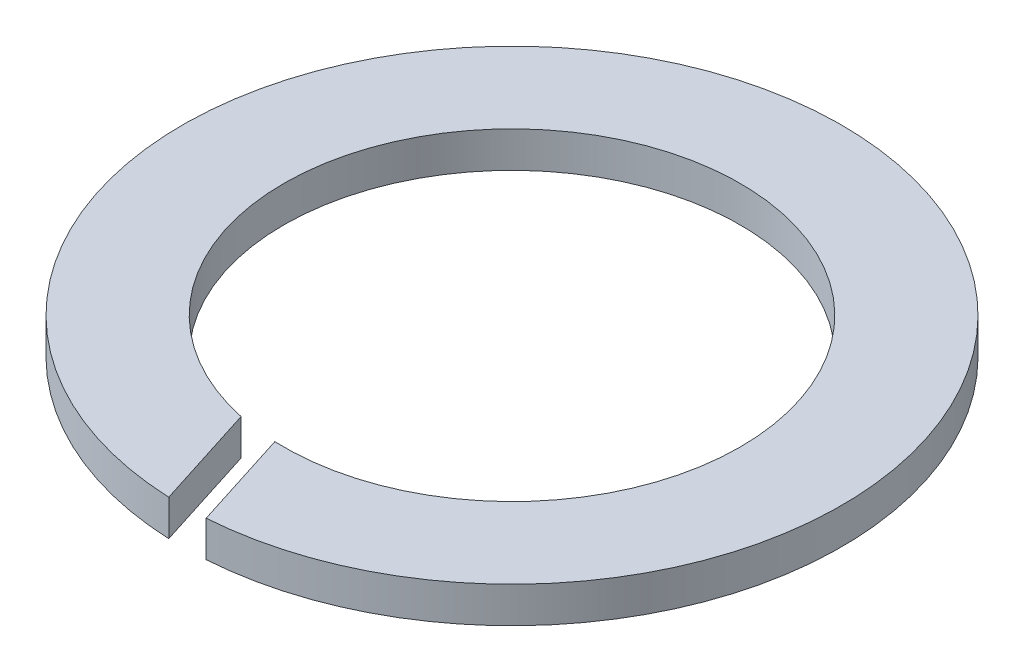
ISO-10303-21;
HEADER;
FILE_DESCRIPTION(('STEP AP214'),'2;1');
FILE_NAME('part.step','',(''),(''),'','','');
FILE_SCHEMA(('AUTOMOTIVE_DESIGN { 1 0 10303 214 1 1 1 1 }'));
ENDSEC;
DATA;
#1=APPLICATION_CONTEXT('core data for automotive mechanical design processes');
#2=APPLICATION_PROTOCOL_DEFINITION('international standard','automotive_design',2000,#1);
#3=PRODUCT_CONTEXT('',#1,'mechanical');
#4=PRODUCT('Part','Part','',(#3));
#5=PRODUCT_RELATED_PRODUCT_CATEGORY('part','',(#4));
#6=PRODUCT_DEFINITION_FORMATION('','',#4);
#7=PRODUCT_DEFINITION_CONTEXT('part definition',#1,'design');
#8=PRODUCT_DEFINITION('design','',#6,#7);
#9=PRODUCT_DEFINITION_SHAPE('','',#8);
#10=(LENGTH_UNIT() NAMED_UNIT(*) SI_UNIT(.MILLI.,.METRE.));
#11=(NAMED_UNIT(*) PLANE_ANGLE_UNIT() SI_UNIT($,.RADIAN.));
#12=(NAMED_UNIT(*) SI_UNIT($,.STERADIAN.) SOLID_ANGLE_UNIT());
#13=UNCERTAINTY_MEASURE_WITH_UNIT(LENGTH_MEASURE(1.E-05),#10,'distance_accuracy_value','');
#14=(GEOMETRIC_REPRESENTATION_CONTEXT(3) GLOBAL_UNCERTAINTY_ASSIGNED_CONTEXT((#13)) GLOBAL_UNIT_ASSIGNED_CONTEXT((#10,
#11,#12)) REPRESENTATION_CONTEXT('',''));
#15=CARTESIAN_POINT('',(0.,0.,0.));
#16=DIRECTION('',(0.,0.,1.));
#17=DIRECTION('',(1.,0.,0.));
#18=AXIS2_PLACEMENT_3D('',#15,#16,#17);
#19=CARTESIAN_POINT('',(0.,3.,0.));
#20=DIRECTION('',(0.,1.,0.));
#21=DIRECTION('',(0.,0.,1.));
#22=AXIS2_PLACEMENT_3D('',#19,#20,#21);
#23=PLANE('',#22);
#24=DIRECTION('',(0.302773703904432,0.,0.953062476558589));
#25=VECTOR('',#24,1.);
#26=CARTESIAN_POINT('',(-1.17083366932693,3.,27.4750641221958));
#27=LINE('',#26,#25);
#28=CARTESIAN_POINT('',(-3.98097039625581,3.,18.6293954465553));
#29=VERTEX_POINT('',#28);
#30=CARTESIAN_POINT('',(-1.17083366932693,3.,27.4750641221958));
#31=VERTEX_POINT('',#30);
#32=EDGE_CURVE('E77',#29,#31,#27,.T.);
#33=ORIENTED_EDGE('',*,*,#32,.F.);
#34=CARTESIAN_POINT('',(0.,3.,0.));
#35=DIRECTION('',(0.,1.,0.));
#36=DIRECTION('',(0.,0.,1.));
#37=AXIS2_PLACEMENT_3D('',#34,#35,#36);
#38=CIRCLE('',#37,19.05);
#39=CARTESIAN_POINT('',(-0.758402040441473,3.,19.0348975921872));
#40=VERTEX_POINT('',#39);
#41=EDGE_CURVE('E89',#40,#29,#38,.T.);
#42=ORIENTED_EDGE('',*,*,#41,.F.);
#43=DIRECTION('',(-0.302773703904432,0.,-0.953062476558589));
#44=VECTOR('',#43,1.);
#45=CARTESIAN_POINT('',(-1.17083366932693,3.,17.7366570099709));
#46=LINE('',#45,#44);
#47=CARTESIAN_POINT('',(1.90974292251743,3.,27.4336086209943));
#48=VERTEX_POINT('',#47);
#49=EDGE_CURVE('E59',#48,#40,#46,.T.);
#50=ORIENTED_EDGE('',*,*,#49,.F.);
#51=CARTESIAN_POINT('',(0.,3.,0.));
#52=DIRECTION('',(0.,1.,0.));
#53=DIRECTION('',(0.,0.,1.));
#54=AXIS2_PLACEMENT_3D('',#51,#52,#53);
#55=CIRCLE('',#54,27.5);
#56=EDGE_CURVE('E45',#48,#31,#55,.T.);
#57=ORIENTED_EDGE('',*,*,#56,.T.);
#58=EDGE_LOOP('',(#33,#42,#50,#57));
#59=FACE_BOUND('',#58,.T.);
#60=ADVANCED_FACE('F37',(#59),#23,.T.);
#61=CARTESIAN_POINT('',(0.,0.,0.));
#62=DIRECTION('',(0.,1.,0.));
#63=DIRECTION('',(0.,0.,1.));
#64=AXIS2_PLACEMENT_3D('',#61,#62,#63);
#65=PLANE('',#64);
#66=CARTESIAN_POINT('',(0.,0.,0.));
#67=DIRECTION('',(0.,1.,0.));
#68=DIRECTION('',(0.,0.,1.));
#69=AXIS2_PLACEMENT_3D('',#66,#67,#68);
#70=CIRCLE('',#69,19.05);
#71=CARTESIAN_POINT('',(-0.758402040441473,0.,19.0348975921872));
#72=VERTEX_POINT('',#71);
#73=CARTESIAN_POINT('',(-3.9809703962558,0.,18.6293954465553));
#74=VERTEX_POINT('',#73);
#75=EDGE_CURVE('E94',#72,#74,#70,.T.);
#76=ORIENTED_EDGE('',*,*,#75,.T.);
#77=DIRECTION('',(0.302773703904431,0.,0.953062476558589));
#78=VECTOR('',#77,1.);
#79=CARTESIAN_POINT('',(-0.475304011083091,0.,29.6644326507621));
#80=LINE('',#79,#78);
#81=CARTESIAN_POINT('',(-1.17083366932693,0.,27.4750641221958));
#82=VERTEX_POINT('',#81);
#83=EDGE_CURVE('E52',#74,#82,#80,.T.);
#84=ORIENTED_EDGE('',*,*,#83,.T.);
#85=CARTESIAN_POINT('',(0.,0.,0.));
#86=DIRECTION('',(0.,1.,0.));
#87=DIRECTION('',(0.,0.,1.));
#88=AXIS2_PLACEMENT_3D('',#85,#86,#87);
#89=CIRCLE('',#88,27.5);
#90=CARTESIAN_POINT('',(1.90974292251743,0.,27.4336086209943));
#91=VERTEX_POINT('',#90);
#92=EDGE_CURVE('E93',#91,#82,#89,.T.);
#93=ORIENTED_EDGE('',*,*,#92,.F.);
#94=DIRECTION('',(-0.302773703904432,0.,-0.953062476558589));
#95=VECTOR('',#94,1.);
#96=CARTESIAN_POINT('',(-1.17083366932693,0.,17.7366570099709));
#97=LINE('',#96,#95);
#98=EDGE_CURVE('E84',#91,#72,#97,.T.);
#99=ORIENTED_EDGE('',*,*,#98,.T.);
#100=EDGE_LOOP('',(#76,#84,#93,#99));
#101=FACE_BOUND('',#100,.T.);
#102=ADVANCED_FACE('F109',(#101),#65,.F.);
#103=CARTESIAN_POINT('',(0.,3.,0.));
#104=DIRECTION('',(0.,-1.,0.));
#105=DIRECTION('',(0.,0.,-1.));
#106=AXIS2_PLACEMENT_3D('',#103,#104,#105);
#107=CYLINDRICAL_SURFACE('',#106,27.5);
#108=ORIENTED_EDGE('',*,*,#92,.T.);
#109=DIRECTION('',(0.,-1.,0.));
#110=VECTOR('',#109,1.);
#111=CARTESIAN_POINT('',(-1.17083366932693,3.,27.4750641221958));
#112=LINE('',#111,#110);
#113=EDGE_CURVE('E97',#82,#31,#112,.F.);
#114=ORIENTED_EDGE('',*,*,#113,.T.);
#115=ORIENTED_EDGE('',*,*,#56,.F.);
#116=DIRECTION('',(0.,-1.,0.));
#117=VECTOR('',#116,1.);
#118=CARTESIAN_POINT('',(1.90974292251743,3.,27.4336086209943));
#119=LINE('',#118,#117);
#120=EDGE_CURVE('E83',#48,#91,#119,.T.);
#121=ORIENTED_EDGE('',*,*,#120,.T.);
#122=EDGE_LOOP('',(#108,#114,#115,#121));
#123=FACE_BOUND('',#122,.T.);
#124=ADVANCED_FACE('F39',(#123),#107,.T.);
#125=CARTESIAN_POINT('',(0.,3.,0.));
#126=DIRECTION('',(0.,-1.,0.));
#127=DIRECTION('',(0.,0.,-1.));
#128=AXIS2_PLACEMENT_3D('',#125,#126,#127);
#129=CYLINDRICAL_SURFACE('',#128,19.05);
#130=DIRECTION('',(0.,1.,0.));
#131=VECTOR('',#130,1.);
#132=CARTESIAN_POINT('',(-3.98097039625581,0.,18.6293954465553));
#133=LINE('',#132,#131);
#134=EDGE_CURVE('E74',#74,#29,#133,.T.);
#135=ORIENTED_EDGE('',*,*,#134,.F.);
#136=ORIENTED_EDGE('',*,*,#75,.F.);
#137=DIRECTION('',(0.,-1.,0.));
#138=VECTOR('',#137,1.);
#139=CARTESIAN_POINT('',(-0.758402040441473,3.,19.0348975921872));
#140=LINE('',#139,#138);
#141=EDGE_CURVE('E11',#40,#72,#140,.T.);
#142=ORIENTED_EDGE('',*,*,#141,.F.);
#143=ORIENTED_EDGE('',*,*,#41,.T.);
#144=EDGE_LOOP('',(#135,#136,#142,#143));
#145=FACE_BOUND('',#144,.T.);
#146=ADVANCED_FACE('F92',(#145),#129,.F.);
#147=CARTESIAN_POINT('',(-1.17083366932693,0.,17.7366570099709));
#148=DIRECTION('',(0.953062476558589,0.,-0.302773703904432));
#149=DIRECTION('',(-0.302773703904432,0.,-0.953062476558589));
#150=AXIS2_PLACEMENT_3D('',#147,#148,#149);
#151=PLANE('',#150);
#152=ORIENTED_EDGE('',*,*,#49,.T.);
#153=ORIENTED_EDGE('',*,*,#141,.T.);
#154=ORIENTED_EDGE('',*,*,#98,.F.);
#155=ORIENTED_EDGE('',*,*,#120,.F.);
#156=EDGE_LOOP('',(#152,#153,#154,#155));
#157=FACE_BOUND('',#156,.T.);
#158=ADVANCED_FACE('F111',(#157),#151,.F.);
#159=CARTESIAN_POINT('',(-1.17083366932693,0.,27.4750641221958));
#160=DIRECTION('',(-0.953062476558589,0.,0.302773703904432));
#161=DIRECTION('',(0.302773703904432,0.,0.953062476558589));
#162=AXIS2_PLACEMENT_3D('',#159,#160,#161);
#163=PLANE('',#162);
#164=ORIENTED_EDGE('',*,*,#83,.F.);
#165=ORIENTED_EDGE('',*,*,#134,.T.);
#166=ORIENTED_EDGE('',*,*,#32,.T.);
#167=ORIENTED_EDGE('',*,*,#113,.F.);
#168=EDGE_LOOP('',(#164,#165,#166,#167));
#169=FACE_BOUND('',#168,.T.);
#170=ADVANCED_FACE('F76',(#169),#163,.F.);
#171=CLOSED_SHELL('',(#60,#102,#124,#146,#158,#170));
#172=MANIFOLD_SOLID_BREP('B2',#171);
#173=ADVANCED_BREP_SHAPE_REPRESENTATION('',(#18,#172),#14);
#174=SHAPE_DEFINITION_REPRESENTATION(#9,#173);
ENDSEC;
END-ISO-10303-21;
